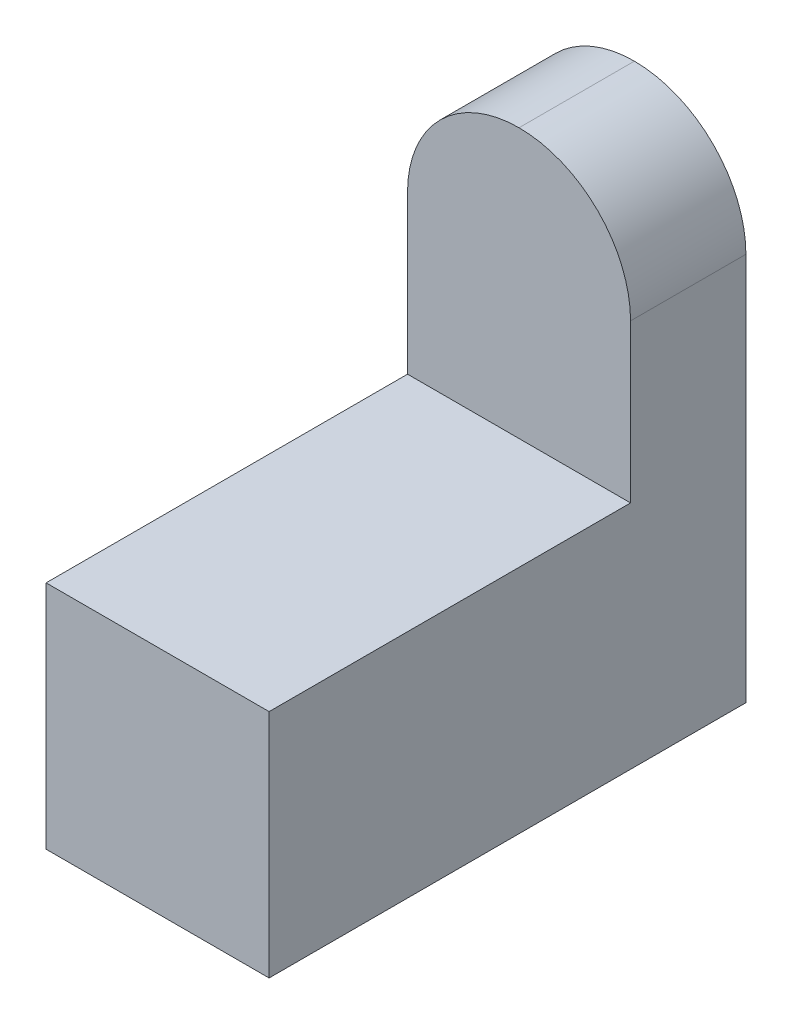
ISO-10303-21;
HEADER;
FILE_DESCRIPTION(('STEP AP214'),'2;1');
FILE_NAME('part.step','',(''),(''),'','','');
FILE_SCHEMA(('AUTOMOTIVE_DESIGN { 1 0 10303 214 1 1 1 1 }'));
ENDSEC;
DATA;
#1=APPLICATION_CONTEXT('core data for automotive mechanical design processes');
#2=APPLICATION_PROTOCOL_DEFINITION('international standard','automotive_design',2000,#1);
#3=PRODUCT_CONTEXT('',#1,'mechanical');
#4=PRODUCT('Part','Part','',(#3));
#5=PRODUCT_RELATED_PRODUCT_CATEGORY('part','',(#4));
#6=PRODUCT_DEFINITION_FORMATION('','',#4);
#7=PRODUCT_DEFINITION_CONTEXT('part definition',#1,'design');
#8=PRODUCT_DEFINITION('design','',#6,#7);
#9=PRODUCT_DEFINITION_SHAPE('','',#8);
#10=(LENGTH_UNIT() NAMED_UNIT(*) SI_UNIT(.MILLI.,.METRE.));
#11=(NAMED_UNIT(*) PLANE_ANGLE_UNIT() SI_UNIT($,.RADIAN.));
#12=(NAMED_UNIT(*) SI_UNIT($,.STERADIAN.) SOLID_ANGLE_UNIT());
#13=UNCERTAINTY_MEASURE_WITH_UNIT(LENGTH_MEASURE(1.E-05),#10,'distance_accuracy_value','');
#14=(GEOMETRIC_REPRESENTATION_CONTEXT(3) GLOBAL_UNCERTAINTY_ASSIGNED_CONTEXT((#13)) GLOBAL_UNIT_ASSIGNED_CONTEXT((#10,
#11,#12)) REPRESENTATION_CONTEXT('',''));
#15=CARTESIAN_POINT('',(0.,0.,0.));
#16=DIRECTION('',(0.,0.,1.));
#17=DIRECTION('',(1.,0.,0.));
#18=AXIS2_PLACEMENT_3D('',#15,#16,#17);
#19=CARTESIAN_POINT('',(14.5,65.,0.));
#20=DIRECTION('',(0.,0.,1.));
#21=DIRECTION('',(1.,0.,0.));
#22=AXIS2_PLACEMENT_3D('',#19,#20,#21);
#23=PLANE('',#22);
#24=DIRECTION('',(0.,1.,0.));
#25=VECTOR('',#24,1.);
#26=CARTESIAN_POINT('',(-14.5,65.,0.));
#27=LINE('',#26,#25);
#28=CARTESIAN_POINT('',(-14.5,0.,0.));
#29=VERTEX_POINT('',#28);
#30=CARTESIAN_POINT('',(-14.5,50.5,0.));
#31=VERTEX_POINT('',#30);
#32=EDGE_CURVE('E131',#29,#31,#27,.T.);
#33=ORIENTED_EDGE('',*,*,#32,.T.);
#34=CARTESIAN_POINT('',(0.,50.5,0.));
#35=DIRECTION('',(0.,0.,1.));
#36=DIRECTION('',(1.,0.,0.));
#37=AXIS2_PLACEMENT_3D('',#34,#35,#36);
#38=CIRCLE('',#37,14.5);
#39=CARTESIAN_POINT('',(0.,65.,0.));
#40=VERTEX_POINT('',#39);
#41=EDGE_CURVE('E52',#31,#40,#38,.F.);
#42=ORIENTED_EDGE('',*,*,#41,.T.);
#43=CARTESIAN_POINT('',(0.,50.5,0.));
#44=DIRECTION('',(0.,0.,1.));
#45=DIRECTION('',(1.,0.,0.));
#46=AXIS2_PLACEMENT_3D('',#43,#44,#45);
#47=CIRCLE('',#46,14.5);
#48=CARTESIAN_POINT('',(14.5,50.5,0.));
#49=VERTEX_POINT('',#48);
#50=EDGE_CURVE('E59',#40,#49,#47,.F.);
#51=ORIENTED_EDGE('',*,*,#50,.T.);
#52=DIRECTION('',(0.,1.,0.));
#53=VECTOR('',#52,1.);
#54=CARTESIAN_POINT('',(14.5,65.,0.));
#55=LINE('',#54,#53);
#56=CARTESIAN_POINT('',(14.5,0.,0.));
#57=VERTEX_POINT('',#56);
#58=EDGE_CURVE('E108',#57,#49,#55,.T.);
#59=ORIENTED_EDGE('',*,*,#58,.F.);
#60=DIRECTION('',(-1.,0.,0.));
#61=VECTOR('',#60,1.);
#62=CARTESIAN_POINT('',(14.5,0.,0.));
#63=LINE('',#62,#61);
#64=EDGE_CURVE('E130',#57,#29,#63,.T.);
#65=ORIENTED_EDGE('',*,*,#64,.T.);
#66=EDGE_LOOP('',(#33,#42,#51,#59,#65));
#67=FACE_BOUND('',#66,.T.);
#68=ADVANCED_FACE('F43',(#67),#23,.F.);
#69=CARTESIAN_POINT('',(14.5,30.,15.));
#70=DIRECTION('',(0.,0.,-1.));
#71=DIRECTION('',(-1.,0.,0.));
#72=AXIS2_PLACEMENT_3D('',#69,#70,#71);
#73=PLANE('',#72);
#74=CARTESIAN_POINT('',(0.,50.5,15.));
#75=DIRECTION('',(0.,0.,-1.));
#76=DIRECTION('',(-1.,0.,0.));
#77=AXIS2_PLACEMENT_3D('',#74,#75,#76);
#78=CIRCLE('',#77,14.5);
#79=CARTESIAN_POINT('',(14.5,50.5,15.));
#80=VERTEX_POINT('',#79);
#81=CARTESIAN_POINT('',(0.,65.,15.));
#82=VERTEX_POINT('',#81);
#83=EDGE_CURVE('E117',#80,#82,#78,.F.);
#84=ORIENTED_EDGE('',*,*,#83,.T.);
#85=CARTESIAN_POINT('',(0.,50.5,15.));
#86=DIRECTION('',(0.,0.,-1.));
#87=DIRECTION('',(-1.,0.,0.));
#88=AXIS2_PLACEMENT_3D('',#85,#86,#87);
#89=CIRCLE('',#88,14.5);
#90=CARTESIAN_POINT('',(-14.5,50.5,15.));
#91=VERTEX_POINT('',#90);
#92=EDGE_CURVE('E147',#82,#91,#89,.F.);
#93=ORIENTED_EDGE('',*,*,#92,.T.);
#94=DIRECTION('',(0.,-1.,0.));
#95=VECTOR('',#94,1.);
#96=CARTESIAN_POINT('',(-14.5,30.,15.));
#97=LINE('',#96,#95);
#98=CARTESIAN_POINT('',(-14.5,30.,15.));
#99=VERTEX_POINT('',#98);
#100=EDGE_CURVE('E114',#91,#99,#97,.T.);
#101=ORIENTED_EDGE('',*,*,#100,.T.);
#102=DIRECTION('',(-1.,0.,0.));
#103=VECTOR('',#102,1.);
#104=CARTESIAN_POINT('',(14.5,30.,15.));
#105=LINE('',#104,#103);
#106=CARTESIAN_POINT('',(14.5,30.,15.));
#107=VERTEX_POINT('',#106);
#108=EDGE_CURVE('E111',#107,#99,#105,.T.);
#109=ORIENTED_EDGE('',*,*,#108,.F.);
#110=DIRECTION('',(0.,-1.,0.));
#111=VECTOR('',#110,1.);
#112=CARTESIAN_POINT('',(14.5,30.,15.));
#113=LINE('',#112,#111);
#114=EDGE_CURVE('E99',#80,#107,#113,.T.);
#115=ORIENTED_EDGE('',*,*,#114,.F.);
#116=EDGE_LOOP('',(#84,#93,#101,#109,#115));
#117=FACE_BOUND('',#116,.T.);
#118=ADVANCED_FACE('F112',(#117),#73,.F.);
#119=CARTESIAN_POINT('',(14.5,30.,62.));
#120=DIRECTION('',(0.,-1.,0.));
#121=DIRECTION('',(0.,0.,-1.));
#122=AXIS2_PLACEMENT_3D('',#119,#120,#121);
#123=PLANE('',#122);
#124=DIRECTION('',(0.,0.,1.));
#125=VECTOR('',#124,1.);
#126=CARTESIAN_POINT('',(-14.5,30.,62.));
#127=LINE('',#126,#125);
#128=CARTESIAN_POINT('',(-14.5,30.,62.));
#129=VERTEX_POINT('',#128);
#130=EDGE_CURVE('E134',#99,#129,#127,.T.);
#131=ORIENTED_EDGE('',*,*,#130,.T.);
#132=DIRECTION('',(-1.,0.,0.));
#133=VECTOR('',#132,1.);
#134=CARTESIAN_POINT('',(14.5,30.,62.));
#135=LINE('',#134,#133);
#136=CARTESIAN_POINT('',(14.5,30.,62.));
#137=VERTEX_POINT('',#136);
#138=EDGE_CURVE('E118',#137,#129,#135,.T.);
#139=ORIENTED_EDGE('',*,*,#138,.F.);
#140=DIRECTION('',(0.,0.,1.));
#141=VECTOR('',#140,1.);
#142=CARTESIAN_POINT('',(14.5,30.,62.));
#143=LINE('',#142,#141);
#144=EDGE_CURVE('E103',#107,#137,#143,.T.);
#145=ORIENTED_EDGE('',*,*,#144,.F.);
#146=ORIENTED_EDGE('',*,*,#108,.T.);
#147=EDGE_LOOP('',(#131,#139,#145,#146));
#148=FACE_BOUND('',#147,.T.);
#149=ADVANCED_FACE('F120',(#148),#123,.F.);
#150=CARTESIAN_POINT('',(14.5,0.,62.));
#151=DIRECTION('',(0.,0.,-1.));
#152=DIRECTION('',(-1.,0.,0.));
#153=AXIS2_PLACEMENT_3D('',#150,#151,#152);
#154=PLANE('',#153);
#155=DIRECTION('',(0.,-1.,0.));
#156=VECTOR('',#155,1.);
#157=CARTESIAN_POINT('',(-14.5,0.,62.));
#158=LINE('',#157,#156);
#159=CARTESIAN_POINT('',(-14.5,0.,62.));
#160=VERTEX_POINT('',#159);
#161=EDGE_CURVE('E136',#129,#160,#158,.T.);
#162=ORIENTED_EDGE('',*,*,#161,.T.);
#163=DIRECTION('',(-1.,0.,0.));
#164=VECTOR('',#163,1.);
#165=CARTESIAN_POINT('',(14.5,0.,62.));
#166=LINE('',#165,#164);
#167=CARTESIAN_POINT('',(14.5,0.,62.));
#168=VERTEX_POINT('',#167);
#169=EDGE_CURVE('E142',#168,#160,#166,.T.);
#170=ORIENTED_EDGE('',*,*,#169,.F.);
#171=DIRECTION('',(0.,-1.,0.));
#172=VECTOR('',#171,1.);
#173=CARTESIAN_POINT('',(14.5,0.,62.));
#174=LINE('',#173,#172);
#175=EDGE_CURVE('E123',#137,#168,#174,.T.);
#176=ORIENTED_EDGE('',*,*,#175,.F.);
#177=ORIENTED_EDGE('',*,*,#138,.T.);
#178=EDGE_LOOP('',(#162,#170,#176,#177));
#179=FACE_BOUND('',#178,.T.);
#180=ADVANCED_FACE('F167',(#179),#154,.F.);
#181=CARTESIAN_POINT('',(14.5,0.,0.));
#182=DIRECTION('',(0.,1.,0.));
#183=DIRECTION('',(0.,0.,1.));
#184=AXIS2_PLACEMENT_3D('',#181,#182,#183);
#185=PLANE('',#184);
#186=DIRECTION('',(0.,0.,-1.));
#187=VECTOR('',#186,1.);
#188=CARTESIAN_POINT('',(-14.5,0.,0.));
#189=LINE('',#188,#187);
#190=EDGE_CURVE('E138',#160,#29,#189,.T.);
#191=ORIENTED_EDGE('',*,*,#190,.T.);
#192=ORIENTED_EDGE('',*,*,#64,.F.);
#193=DIRECTION('',(0.,0.,-1.));
#194=VECTOR('',#193,1.);
#195=CARTESIAN_POINT('',(14.5,0.,0.));
#196=LINE('',#195,#194);
#197=EDGE_CURVE('E125',#168,#57,#196,.T.);
#198=ORIENTED_EDGE('',*,*,#197,.F.);
#199=ORIENTED_EDGE('',*,*,#169,.T.);
#200=EDGE_LOOP('',(#191,#192,#198,#199));
#201=FACE_BOUND('',#200,.T.);
#202=ADVANCED_FACE('F163',(#201),#185,.F.);
#203=CARTESIAN_POINT('',(14.5,0.,0.));
#204=DIRECTION('',(-1.,0.,0.));
#205=DIRECTION('',(0.,0.,1.));
#206=AXIS2_PLACEMENT_3D('',#203,#204,#205);
#207=PLANE('',#206);
#208=ORIENTED_EDGE('',*,*,#58,.T.);
#209=DIRECTION('',(0.,0.,1.));
#210=VECTOR('',#209,1.);
#211=CARTESIAN_POINT('',(14.5,50.5,0.));
#212=LINE('',#211,#210);
#213=EDGE_CURVE('E11',#49,#80,#212,.T.);
#214=ORIENTED_EDGE('',*,*,#213,.T.);
#215=ORIENTED_EDGE('',*,*,#114,.T.);
#216=ORIENTED_EDGE('',*,*,#144,.T.);
#217=ORIENTED_EDGE('',*,*,#175,.T.);
#218=ORIENTED_EDGE('',*,*,#197,.T.);
#219=EDGE_LOOP('',(#208,#214,#215,#216,#217,#218));
#220=FACE_BOUND('',#219,.T.);
#221=ADVANCED_FACE('F101',(#220),#207,.F.);
#222=CARTESIAN_POINT('',(-14.5,0.,0.));
#223=DIRECTION('',(-1.,0.,0.));
#224=DIRECTION('',(0.,0.,1.));
#225=AXIS2_PLACEMENT_3D('',#222,#223,#224);
#226=PLANE('',#225);
#227=ORIENTED_EDGE('',*,*,#100,.F.);
#228=DIRECTION('',(0.,0.,1.));
#229=VECTOR('',#228,1.);
#230=CARTESIAN_POINT('',(-14.5,50.5,0.));
#231=LINE('',#230,#229);
#232=EDGE_CURVE('E149',#91,#31,#231,.F.);
#233=ORIENTED_EDGE('',*,*,#232,.T.);
#234=ORIENTED_EDGE('',*,*,#32,.F.);
#235=ORIENTED_EDGE('',*,*,#190,.F.);
#236=ORIENTED_EDGE('',*,*,#161,.F.);
#237=ORIENTED_EDGE('',*,*,#130,.F.);
#238=EDGE_LOOP('',(#227,#233,#234,#235,#236,#237));
#239=FACE_BOUND('',#238,.T.);
#240=ADVANCED_FACE('F156',(#239),#226,.T.);
#241=CARTESIAN_POINT('',(0.,50.5,0.));
#242=DIRECTION('',(0.,0.,1.));
#243=DIRECTION('',(1.,0.,0.));
#244=AXIS2_PLACEMENT_3D('',#241,#242,#243);
#245=CYLINDRICAL_SURFACE('',#244,14.5);
#246=ORIENTED_EDGE('',*,*,#213,.F.);
#247=ORIENTED_EDGE('',*,*,#50,.F.);
#248=DIRECTION('',(0.,0.,1.));
#249=VECTOR('',#248,1.);
#250=CARTESIAN_POINT('',(0.,65.,15.));
#251=LINE('',#250,#249);
#252=EDGE_CURVE('E47',#82,#40,#251,.F.);
#253=ORIENTED_EDGE('',*,*,#252,.F.);
#254=ORIENTED_EDGE('',*,*,#83,.F.);
#255=EDGE_LOOP('',(#246,#247,#253,#254));
#256=FACE_BOUND('',#255,.T.);
#257=ADVANCED_FACE('F45',(#256),#245,.T.);
#258=CARTESIAN_POINT('',(0.,50.5,15.));
#259=DIRECTION('',(0.,0.,-1.));
#260=DIRECTION('',(-1.,0.,0.));
#261=AXIS2_PLACEMENT_3D('',#258,#259,#260);
#262=CYLINDRICAL_SURFACE('',#261,14.5);
#263=ORIENTED_EDGE('',*,*,#41,.F.);
#264=ORIENTED_EDGE('',*,*,#232,.F.);
#265=ORIENTED_EDGE('',*,*,#92,.F.);
#266=ORIENTED_EDGE('',*,*,#252,.T.);
#267=EDGE_LOOP('',(#263,#264,#265,#266));
#268=FACE_BOUND('',#267,.T.);
#269=ADVANCED_FACE('F171',(#268),#262,.T.);
#270=CLOSED_SHELL('',(#68,#118,#149,#180,#202,#221,#240,#257,#269));
#271=MANIFOLD_SOLID_BREP('B2',#270);
#272=ADVANCED_BREP_SHAPE_REPRESENTATION('',(#18,#271),#14);
#273=SHAPE_DEFINITION_REPRESENTATION(#9,#272);
ENDSEC;
END-ISO-10303-21;
